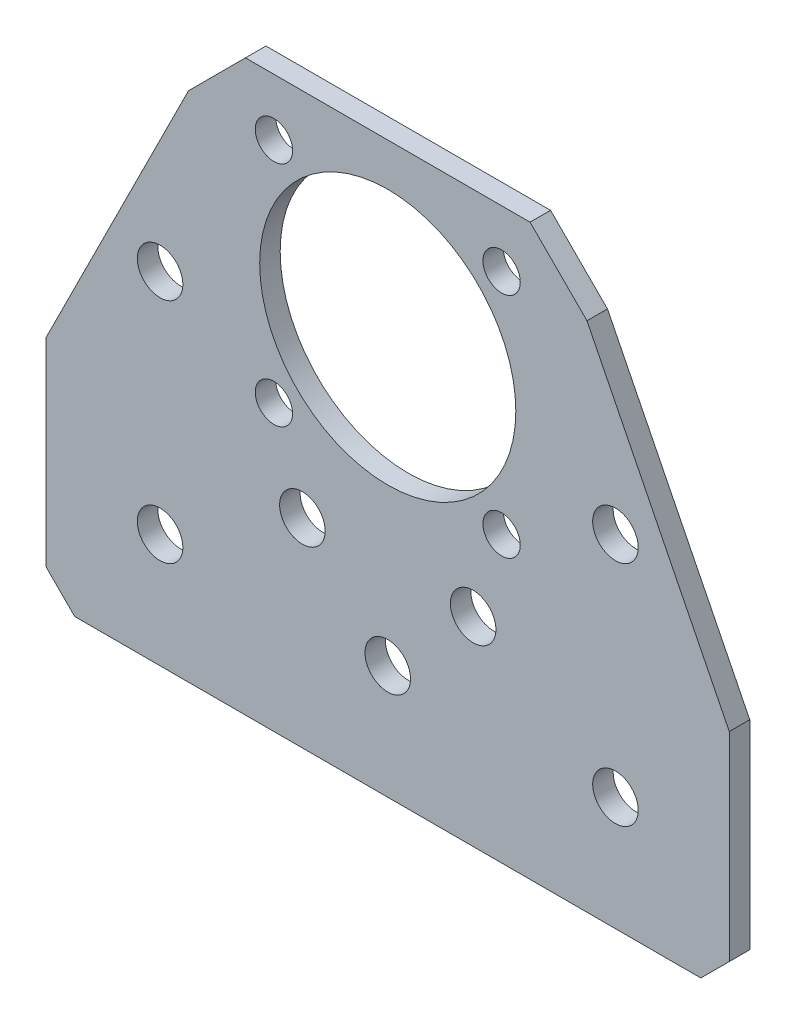
ISO-10303-21;
HEADER;
FILE_DESCRIPTION(('STEP AP214'),'2;1');
FILE_NAME('part.step','',(''),(''),'','','');
FILE_SCHEMA(('AUTOMOTIVE_DESIGN { 1 0 10303 214 1 1 1 1 }'));
ENDSEC;
DATA;
#1=APPLICATION_CONTEXT('core data for automotive mechanical design processes');
#2=APPLICATION_PROTOCOL_DEFINITION('international standard','automotive_design',2000,#1);
#3=PRODUCT_CONTEXT('',#1,'mechanical');
#4=PRODUCT('Part','Part','',(#3));
#5=PRODUCT_RELATED_PRODUCT_CATEGORY('part','',(#4));
#6=PRODUCT_DEFINITION_FORMATION('','',#4);
#7=PRODUCT_DEFINITION_CONTEXT('part definition',#1,'design');
#8=PRODUCT_DEFINITION('design','',#6,#7);
#9=PRODUCT_DEFINITION_SHAPE('','',#8);
#10=(LENGTH_UNIT() NAMED_UNIT(*) SI_UNIT(.MILLI.,.METRE.));
#11=(NAMED_UNIT(*) PLANE_ANGLE_UNIT() SI_UNIT($,.RADIAN.));
#12=(NAMED_UNIT(*) SI_UNIT($,.STERADIAN.) SOLID_ANGLE_UNIT());
#13=UNCERTAINTY_MEASURE_WITH_UNIT(LENGTH_MEASURE(1.E-05),#10,'distance_accuracy_value','');
#14=(GEOMETRIC_REPRESENTATION_CONTEXT(3) GLOBAL_UNCERTAINTY_ASSIGNED_CONTEXT((#13)) GLOBAL_UNIT_ASSIGNED_CONTEXT((#10,
#11,#12)) REPRESENTATION_CONTEXT('',''));
#15=CARTESIAN_POINT('',(0.,0.,0.));
#16=DIRECTION('',(0.,0.,1.));
#17=DIRECTION('',(1.,0.,0.));
#18=AXIS2_PLACEMENT_3D('',#15,#16,#17);
#19=CARTESIAN_POINT('',(0.,0.,-2.286));
#20=DIRECTION('',(0.,0.,1.));
#21=DIRECTION('',(1.,0.,0.));
#22=AXIS2_PLACEMENT_3D('',#19,#20,#21);
#23=PLANE('',#22);
#24=CARTESIAN_POINT('',(-25.4,0.,-2.286));
#25=DIRECTION('',(0.,0.,-1.));
#26=DIRECTION('',(-1.,0.,0.));
#27=AXIS2_PLACEMENT_3D('',#24,#25,#26);
#28=CIRCLE('',#27,2.54);
#29=CARTESIAN_POINT('',(-27.94,0.,-2.286));
#30=VERTEX_POINT('',#29);
#31=EDGE_CURVE('E155',#30,#30,#28,.F.);
#32=ORIENTED_EDGE('',*,*,#31,.T.);
#33=EDGE_LOOP('',(#32));
#34=FACE_BOUND('',#33,.T.);
#35=DIRECTION('',(-0.707106781186549,0.707106781186546,0.));
#36=VECTOR('',#35,1.);
#37=CARTESIAN_POINT('',(-38.1,-9.525,-2.286));
#38=LINE('',#37,#36);
#39=CARTESIAN_POINT('',(-34.925,-12.7,-2.286));
#40=VERTEX_POINT('',#39);
#41=CARTESIAN_POINT('',(-38.1,-9.525,-2.286));
#42=VERTEX_POINT('',#41);
#43=EDGE_CURVE('E92',#40,#42,#38,.T.);
#44=ORIENTED_EDGE('',*,*,#43,.T.);
#45=DIRECTION('',(0.,1.,0.));
#46=VECTOR('',#45,1.);
#47=CARTESIAN_POINT('',(-38.1,12.7,-2.286));
#48=LINE('',#47,#46);
#49=CARTESIAN_POINT('',(-38.1,12.7,-2.286));
#50=VERTEX_POINT('',#49);
#51=EDGE_CURVE('E97',#50,#42,#48,.F.);
#52=ORIENTED_EDGE('',*,*,#51,.F.);
#53=DIRECTION('',(-0.447213595499958,-0.894427190999916,0.));
#54=VECTOR('',#53,1.);
#55=CARTESIAN_POINT('',(-38.1,12.7,-2.286));
#56=LINE('',#55,#54);
#57=CARTESIAN_POINT('',(-22.225,44.45,-2.286));
#58=VERTEX_POINT('',#57);
#59=EDGE_CURVE('E524',#58,#50,#56,.T.);
#60=ORIENTED_EDGE('',*,*,#59,.F.);
#61=DIRECTION('',(0.707106781186549,0.707106781186546,0.));
#62=VECTOR('',#61,1.);
#63=CARTESIAN_POINT('',(-15.875,50.8,-2.286));
#64=LINE('',#63,#62);
#65=CARTESIAN_POINT('',(-15.875,50.8,-2.286));
#66=VERTEX_POINT('',#65);
#67=EDGE_CURVE('E520',#58,#66,#64,.T.);
#68=ORIENTED_EDGE('',*,*,#67,.T.);
#69=DIRECTION('',(1.,0.,0.));
#70=VECTOR('',#69,1.);
#71=CARTESIAN_POINT('',(-19.05,50.8,-2.286));
#72=LINE('',#71,#70);
#73=CARTESIAN_POINT('',(15.875,50.8,-2.286));
#74=VERTEX_POINT('',#73);
#75=EDGE_CURVE('E516',#74,#66,#72,.F.);
#76=ORIENTED_EDGE('',*,*,#75,.F.);
#77=DIRECTION('',(0.70710678118655,-0.707106781186545,0.));
#78=VECTOR('',#77,1.);
#79=CARTESIAN_POINT('',(22.225,44.45,-2.286));
#80=LINE('',#79,#78);
#81=CARTESIAN_POINT('',(22.225,44.4500000000001,-2.286));
#82=VERTEX_POINT('',#81);
#83=EDGE_CURVE('E510',#74,#82,#80,.T.);
#84=ORIENTED_EDGE('',*,*,#83,.T.);
#85=DIRECTION('',(-0.447213595499958,0.894427190999916,0.));
#86=VECTOR('',#85,1.);
#87=CARTESIAN_POINT('',(19.05,50.8,-2.286));
#88=LINE('',#87,#86);
#89=CARTESIAN_POINT('',(38.1,12.7,-2.286));
#90=VERTEX_POINT('',#89);
#91=EDGE_CURVE('E503',#90,#82,#88,.T.);
#92=ORIENTED_EDGE('',*,*,#91,.F.);
#93=DIRECTION('',(0.,1.,0.));
#94=VECTOR('',#93,1.);
#95=CARTESIAN_POINT('',(38.1,12.7,-2.286));
#96=LINE('',#95,#94);
#97=CARTESIAN_POINT('',(38.1,-9.52499999999999,-2.286));
#98=VERTEX_POINT('',#97);
#99=EDGE_CURVE('E492',#98,#90,#96,.T.);
#100=ORIENTED_EDGE('',*,*,#99,.F.);
#101=DIRECTION('',(-0.707106781186544,-0.707106781186551,0.));
#102=VECTOR('',#101,1.);
#103=CARTESIAN_POINT('',(34.925,-12.7,-2.286));
#104=LINE('',#103,#102);
#105=CARTESIAN_POINT('',(34.925,-12.7,-2.286));
#106=VERTEX_POINT('',#105);
#107=EDGE_CURVE('E490',#98,#106,#104,.T.);
#108=ORIENTED_EDGE('',*,*,#107,.T.);
#109=DIRECTION('',(1.,0.,0.));
#110=VECTOR('',#109,1.);
#111=CARTESIAN_POINT('',(-38.1,-12.7,-2.286));
#112=LINE('',#111,#110);
#113=EDGE_CURVE('E110',#40,#106,#112,.T.);
#114=ORIENTED_EDGE('',*,*,#113,.F.);
#115=EDGE_LOOP('',(#44,#52,#60,#68,#76,#84,#92,#100,#108,#114));
#116=FACE_BOUND('',#115,.T.);
#117=CARTESIAN_POINT('',(0.,31.75,-2.286));
#118=DIRECTION('',(0.,0.,1.));
#119=DIRECTION('',(1.,0.,0.));
#120=AXIS2_PLACEMENT_3D('',#117,#118,#119);
#121=CIRCLE('',#120,14.2875);
#122=CARTESIAN_POINT('',(14.2875,31.75,-2.286));
#123=VERTEX_POINT('',#122);
#124=EDGE_CURVE('E106',#123,#123,#121,.T.);
#125=ORIENTED_EDGE('',*,*,#124,.T.);
#126=EDGE_LOOP('',(#125));
#127=FACE_BOUND('',#126,.T.);
#128=CARTESIAN_POINT('',(-12.7,44.45,-2.286));
#129=DIRECTION('',(0.,0.,1.));
#130=DIRECTION('',(1.,0.,0.));
#131=AXIS2_PLACEMENT_3D('',#128,#129,#130);
#132=CIRCLE('',#131,2.0828);
#133=CARTESIAN_POINT('',(-10.6172,44.45,-2.286));
#134=VERTEX_POINT('',#133);
#135=EDGE_CURVE('E160',#134,#134,#132,.T.);
#136=ORIENTED_EDGE('',*,*,#135,.T.);
#137=EDGE_LOOP('',(#136));
#138=FACE_BOUND('',#137,.T.);
#139=CARTESIAN_POINT('',(12.7,44.45,-2.286));
#140=DIRECTION('',(0.,0.,1.));
#141=DIRECTION('',(1.,0.,0.));
#142=AXIS2_PLACEMENT_3D('',#139,#140,#141);
#143=CIRCLE('',#142,2.0828);
#144=CARTESIAN_POINT('',(14.7828,44.45,-2.286));
#145=VERTEX_POINT('',#144);
#146=EDGE_CURVE('E163',#145,#145,#143,.T.);
#147=ORIENTED_EDGE('',*,*,#146,.T.);
#148=EDGE_LOOP('',(#147));
#149=FACE_BOUND('',#148,.T.);
#150=CARTESIAN_POINT('',(-12.7,19.05,-2.286));
#151=DIRECTION('',(0.,0.,1.));
#152=DIRECTION('',(1.,0.,0.));
#153=AXIS2_PLACEMENT_3D('',#150,#151,#152);
#154=CIRCLE('',#153,2.0828);
#155=CARTESIAN_POINT('',(-10.6172,19.05,-2.286));
#156=VERTEX_POINT('',#155);
#157=EDGE_CURVE('E166',#156,#156,#154,.T.);
#158=ORIENTED_EDGE('',*,*,#157,.T.);
#159=EDGE_LOOP('',(#158));
#160=FACE_BOUND('',#159,.T.);
#161=CARTESIAN_POINT('',(12.7,19.05,-2.286));
#162=DIRECTION('',(0.,0.,1.));
#163=DIRECTION('',(1.,0.,0.));
#164=AXIS2_PLACEMENT_3D('',#161,#162,#163);
#165=CIRCLE('',#164,2.0828);
#166=CARTESIAN_POINT('',(14.7828,19.05,-2.286));
#167=VERTEX_POINT('',#166);
#168=EDGE_CURVE('E169',#167,#167,#165,.T.);
#169=ORIENTED_EDGE('',*,*,#168,.T.);
#170=EDGE_LOOP('',(#169));
#171=FACE_BOUND('',#170,.T.);
#172=CARTESIAN_POINT('',(25.4,0.,-2.286));
#173=DIRECTION('',(0.,0.,-1.));
#174=DIRECTION('',(-1.,0.,0.));
#175=AXIS2_PLACEMENT_3D('',#172,#173,#174);
#176=CIRCLE('',#175,2.54);
#177=CARTESIAN_POINT('',(22.86,0.,-2.286));
#178=VERTEX_POINT('',#177);
#179=EDGE_CURVE('E172',#178,#178,#176,.F.);
#180=ORIENTED_EDGE('',*,*,#179,.T.);
#181=EDGE_LOOP('',(#180));
#182=FACE_BOUND('',#181,.T.);
#183=CARTESIAN_POINT('',(0.,0.,-2.286));
#184=DIRECTION('',(0.,0.,-1.));
#185=DIRECTION('',(-1.,0.,0.));
#186=AXIS2_PLACEMENT_3D('',#183,#184,#185);
#187=CIRCLE('',#186,2.54);
#188=CARTESIAN_POINT('',(-2.53999999999999,0.,-2.286));
#189=VERTEX_POINT('',#188);
#190=EDGE_CURVE('E175',#189,#189,#187,.F.);
#191=ORIENTED_EDGE('',*,*,#190,.T.);
#192=EDGE_LOOP('',(#191));
#193=FACE_BOUND('',#192,.T.);
#194=CARTESIAN_POINT('',(-9.525,9.525,-2.286));
#195=DIRECTION('',(0.,0.,1.));
#196=DIRECTION('',(1.,0.,0.));
#197=AXIS2_PLACEMENT_3D('',#194,#195,#196);
#198=CIRCLE('',#197,2.54);
#199=CARTESIAN_POINT('',(-6.985,9.525,-2.286));
#200=VERTEX_POINT('',#199);
#201=EDGE_CURVE('E178',#200,#200,#198,.T.);
#202=ORIENTED_EDGE('',*,*,#201,.T.);
#203=EDGE_LOOP('',(#202));
#204=FACE_BOUND('',#203,.T.);
#205=CARTESIAN_POINT('',(9.525,9.525,-2.286));
#206=DIRECTION('',(0.,0.,1.));
#207=DIRECTION('',(1.,0.,0.));
#208=AXIS2_PLACEMENT_3D('',#205,#206,#207);
#209=CIRCLE('',#208,2.54);
#210=CARTESIAN_POINT('',(12.065,9.525,-2.286));
#211=VERTEX_POINT('',#210);
#212=EDGE_CURVE('E181',#211,#211,#209,.T.);
#213=ORIENTED_EDGE('',*,*,#212,.T.);
#214=EDGE_LOOP('',(#213));
#215=FACE_BOUND('',#214,.T.);
#216=CARTESIAN_POINT('',(25.4,25.4,-2.286));
#217=DIRECTION('',(0.,0.,-1.));
#218=DIRECTION('',(-1.,0.,0.));
#219=AXIS2_PLACEMENT_3D('',#216,#217,#218);
#220=CIRCLE('',#219,2.54);
#221=CARTESIAN_POINT('',(22.86,25.4,-2.286));
#222=VERTEX_POINT('',#221);
#223=EDGE_CURVE('E183',#222,#222,#220,.F.);
#224=ORIENTED_EDGE('',*,*,#223,.T.);
#225=EDGE_LOOP('',(#224));
#226=FACE_BOUND('',#225,.T.);
#227=CARTESIAN_POINT('',(-25.4,25.4,-2.286));
#228=DIRECTION('',(0.,0.,-1.));
#229=DIRECTION('',(-1.,0.,0.));
#230=AXIS2_PLACEMENT_3D('',#227,#228,#229);
#231=CIRCLE('',#230,2.54);
#232=CARTESIAN_POINT('',(-27.94,25.4,-2.286));
#233=VERTEX_POINT('',#232);
#234=EDGE_CURVE('E21',#233,#233,#231,.F.);
#235=ORIENTED_EDGE('',*,*,#234,.T.);
#236=EDGE_LOOP('',(#235));
#237=FACE_BOUND('',#236,.T.);
#238=ADVANCED_FACE('F18',(#34,#116,#127,#138,#149,#160,#171,#182,#193,#204,#215,#226,#237),#23,.F.);
#239=CARTESIAN_POINT('',(-25.4,25.4,0.254));
#240=DIRECTION('',(0.,0.,-1.));
#241=DIRECTION('',(-1.,0.,0.));
#242=AXIS2_PLACEMENT_3D('',#239,#240,#241);
#243=CYLINDRICAL_SURFACE('',#242,2.54);
#244=CARTESIAN_POINT('',(-25.4,25.4,0.));
#245=DIRECTION('',(0.,0.,-1.));
#246=DIRECTION('',(-1.,0.,0.));
#247=AXIS2_PLACEMENT_3D('',#244,#245,#246);
#248=CIRCLE('',#247,2.54);
#249=CARTESIAN_POINT('',(-27.94,25.4,0.));
#250=VERTEX_POINT('',#249);
#251=EDGE_CURVE('E152',#250,#250,#248,.T.);
#252=ORIENTED_EDGE('',*,*,#251,.F.);
#253=EDGE_LOOP('',(#252));
#254=FACE_BOUND('',#253,.T.);
#255=ORIENTED_EDGE('',*,*,#234,.F.);
#256=EDGE_LOOP('',(#255));
#257=FACE_BOUND('',#256,.T.);
#258=ADVANCED_FACE('F191',(#254,#257),#243,.F.);
#259=CARTESIAN_POINT('',(25.4,25.4,0.254));
#260=DIRECTION('',(0.,0.,-1.));
#261=DIRECTION('',(-1.,0.,0.));
#262=AXIS2_PLACEMENT_3D('',#259,#260,#261);
#263=CYLINDRICAL_SURFACE('',#262,2.54);
#264=CARTESIAN_POINT('',(25.4,25.4,0.));
#265=DIRECTION('',(0.,0.,-1.));
#266=DIRECTION('',(-1.,0.,0.));
#267=AXIS2_PLACEMENT_3D('',#264,#265,#266);
#268=CIRCLE('',#267,2.54);
#269=CARTESIAN_POINT('',(22.86,25.4,0.));
#270=VERTEX_POINT('',#269);
#271=EDGE_CURVE('E149',#270,#270,#268,.T.);
#272=ORIENTED_EDGE('',*,*,#271,.F.);
#273=EDGE_LOOP('',(#272));
#274=FACE_BOUND('',#273,.T.);
#275=ORIENTED_EDGE('',*,*,#223,.F.);
#276=EDGE_LOOP('',(#275));
#277=FACE_BOUND('',#276,.T.);
#278=ADVANCED_FACE('F193',(#274,#277),#263,.F.);
#279=CARTESIAN_POINT('',(9.525,9.525,-2.54));
#280=DIRECTION('',(0.,0.,1.));
#281=DIRECTION('',(1.,0.,0.));
#282=AXIS2_PLACEMENT_3D('',#279,#280,#281);
#283=CYLINDRICAL_SURFACE('',#282,2.54);
#284=CARTESIAN_POINT('',(9.525,9.525,0.));
#285=DIRECTION('',(0.,0.,1.));
#286=DIRECTION('',(1.,0.,0.));
#287=AXIS2_PLACEMENT_3D('',#284,#285,#286);
#288=CIRCLE('',#287,2.54);
#289=CARTESIAN_POINT('',(12.065,9.525,0.));
#290=VERTEX_POINT('',#289);
#291=EDGE_CURVE('E146',#290,#290,#288,.F.);
#292=ORIENTED_EDGE('',*,*,#291,.F.);
#293=EDGE_LOOP('',(#292));
#294=FACE_BOUND('',#293,.T.);
#295=ORIENTED_EDGE('',*,*,#212,.F.);
#296=EDGE_LOOP('',(#295));
#297=FACE_BOUND('',#296,.T.);
#298=ADVANCED_FACE('F200',(#294,#297),#283,.F.);
#299=CARTESIAN_POINT('',(-9.525,9.525,-2.54));
#300=DIRECTION('',(0.,0.,1.));
#301=DIRECTION('',(1.,0.,0.));
#302=AXIS2_PLACEMENT_3D('',#299,#300,#301);
#303=CYLINDRICAL_SURFACE('',#302,2.54);
#304=CARTESIAN_POINT('',(-9.525,9.525,0.));
#305=DIRECTION('',(0.,0.,1.));
#306=DIRECTION('',(1.,0.,0.));
#307=AXIS2_PLACEMENT_3D('',#304,#305,#306);
#308=CIRCLE('',#307,2.54);
#309=CARTESIAN_POINT('',(-6.985,9.525,0.));
#310=VERTEX_POINT('',#309);
#311=EDGE_CURVE('E143',#310,#310,#308,.F.);
#312=ORIENTED_EDGE('',*,*,#311,.F.);
#313=EDGE_LOOP('',(#312));
#314=FACE_BOUND('',#313,.T.);
#315=ORIENTED_EDGE('',*,*,#201,.F.);
#316=EDGE_LOOP('',(#315));
#317=FACE_BOUND('',#316,.T.);
#318=ADVANCED_FACE('F279',(#314,#317),#303,.F.);
#319=CARTESIAN_POINT('',(0.,0.,0.254));
#320=DIRECTION('',(0.,0.,-1.));
#321=DIRECTION('',(-1.,0.,0.));
#322=AXIS2_PLACEMENT_3D('',#319,#320,#321);
#323=CYLINDRICAL_SURFACE('',#322,2.54);
#324=CARTESIAN_POINT('',(0.,0.,0.));
#325=DIRECTION('',(0.,0.,-1.));
#326=DIRECTION('',(-1.,0.,0.));
#327=AXIS2_PLACEMENT_3D('',#324,#325,#326);
#328=CIRCLE('',#327,2.54);
#329=CARTESIAN_POINT('',(-2.53999999999999,0.,0.));
#330=VERTEX_POINT('',#329);
#331=EDGE_CURVE('E140',#330,#330,#328,.T.);
#332=ORIENTED_EDGE('',*,*,#331,.F.);
#333=EDGE_LOOP('',(#332));
#334=FACE_BOUND('',#333,.T.);
#335=ORIENTED_EDGE('',*,*,#190,.F.);
#336=EDGE_LOOP('',(#335));
#337=FACE_BOUND('',#336,.T.);
#338=ADVANCED_FACE('F275',(#334,#337),#323,.F.);
#339=CARTESIAN_POINT('',(25.4,0.,0.254));
#340=DIRECTION('',(0.,0.,-1.));
#341=DIRECTION('',(-1.,0.,0.));
#342=AXIS2_PLACEMENT_3D('',#339,#340,#341);
#343=CYLINDRICAL_SURFACE('',#342,2.54);
#344=CARTESIAN_POINT('',(25.4,0.,0.));
#345=DIRECTION('',(0.,0.,-1.));
#346=DIRECTION('',(-1.,0.,0.));
#347=AXIS2_PLACEMENT_3D('',#344,#345,#346);
#348=CIRCLE('',#347,2.54);
#349=CARTESIAN_POINT('',(22.86,0.,0.));
#350=VERTEX_POINT('',#349);
#351=EDGE_CURVE('E137',#350,#350,#348,.T.);
#352=ORIENTED_EDGE('',*,*,#351,.F.);
#353=EDGE_LOOP('',(#352));
#354=FACE_BOUND('',#353,.T.);
#355=ORIENTED_EDGE('',*,*,#179,.F.);
#356=EDGE_LOOP('',(#355));
#357=FACE_BOUND('',#356,.T.);
#358=ADVANCED_FACE('F271',(#354,#357),#343,.F.);
#359=CARTESIAN_POINT('',(12.7,19.05,-2.286));
#360=DIRECTION('',(0.,0.,1.));
#361=DIRECTION('',(1.,0.,0.));
#362=AXIS2_PLACEMENT_3D('',#359,#360,#361);
#363=CYLINDRICAL_SURFACE('',#362,2.0828);
#364=CARTESIAN_POINT('',(12.7,19.05,0.));
#365=DIRECTION('',(0.,0.,1.));
#366=DIRECTION('',(1.,0.,0.));
#367=AXIS2_PLACEMENT_3D('',#364,#365,#366);
#368=CIRCLE('',#367,2.0828);
#369=CARTESIAN_POINT('',(14.7828,19.05,0.));
#370=VERTEX_POINT('',#369);
#371=EDGE_CURVE('E134',#370,#370,#368,.F.);
#372=ORIENTED_EDGE('',*,*,#371,.F.);
#373=EDGE_LOOP('',(#372));
#374=FACE_BOUND('',#373,.T.);
#375=ORIENTED_EDGE('',*,*,#168,.F.);
#376=EDGE_LOOP('',(#375));
#377=FACE_BOUND('',#376,.T.);
#378=ADVANCED_FACE('F267',(#374,#377),#363,.F.);
#379=CARTESIAN_POINT('',(-12.7,19.05,-2.286));
#380=DIRECTION('',(0.,0.,1.));
#381=DIRECTION('',(1.,0.,0.));
#382=AXIS2_PLACEMENT_3D('',#379,#380,#381);
#383=CYLINDRICAL_SURFACE('',#382,2.0828);
#384=CARTESIAN_POINT('',(-12.7,19.05,0.));
#385=DIRECTION('',(0.,0.,1.));
#386=DIRECTION('',(1.,0.,0.));
#387=AXIS2_PLACEMENT_3D('',#384,#385,#386);
#388=CIRCLE('',#387,2.0828);
#389=CARTESIAN_POINT('',(-10.6172,19.05,0.));
#390=VERTEX_POINT('',#389);
#391=EDGE_CURVE('E131',#390,#390,#388,.F.);
#392=ORIENTED_EDGE('',*,*,#391,.F.);
#393=EDGE_LOOP('',(#392));
#394=FACE_BOUND('',#393,.T.);
#395=ORIENTED_EDGE('',*,*,#157,.F.);
#396=EDGE_LOOP('',(#395));
#397=FACE_BOUND('',#396,.T.);
#398=ADVANCED_FACE('F263',(#394,#397),#383,.F.);
#399=CARTESIAN_POINT('',(12.7,44.45,-2.286));
#400=DIRECTION('',(0.,0.,1.));
#401=DIRECTION('',(1.,0.,0.));
#402=AXIS2_PLACEMENT_3D('',#399,#400,#401);
#403=CYLINDRICAL_SURFACE('',#402,2.0828);
#404=CARTESIAN_POINT('',(12.7,44.45,0.));
#405=DIRECTION('',(0.,0.,1.));
#406=DIRECTION('',(1.,0.,0.));
#407=AXIS2_PLACEMENT_3D('',#404,#405,#406);
#408=CIRCLE('',#407,2.0828);
#409=CARTESIAN_POINT('',(14.7828,44.45,0.));
#410=VERTEX_POINT('',#409);
#411=EDGE_CURVE('E128',#410,#410,#408,.F.);
#412=ORIENTED_EDGE('',*,*,#411,.F.);
#413=EDGE_LOOP('',(#412));
#414=FACE_BOUND('',#413,.T.);
#415=ORIENTED_EDGE('',*,*,#146,.F.);
#416=EDGE_LOOP('',(#415));
#417=FACE_BOUND('',#416,.T.);
#418=ADVANCED_FACE('F259',(#414,#417),#403,.F.);
#419=CARTESIAN_POINT('',(-12.7,44.45,-2.286));
#420=DIRECTION('',(0.,0.,1.));
#421=DIRECTION('',(1.,0.,0.));
#422=AXIS2_PLACEMENT_3D('',#419,#420,#421);
#423=CYLINDRICAL_SURFACE('',#422,2.0828);
#424=CARTESIAN_POINT('',(-12.7,44.45,0.));
#425=DIRECTION('',(0.,0.,1.));
#426=DIRECTION('',(1.,0.,0.));
#427=AXIS2_PLACEMENT_3D('',#424,#425,#426);
#428=CIRCLE('',#427,2.0828);
#429=CARTESIAN_POINT('',(-10.6172,44.45,0.));
#430=VERTEX_POINT('',#429);
#431=EDGE_CURVE('E125',#430,#430,#428,.F.);
#432=ORIENTED_EDGE('',*,*,#431,.F.);
#433=EDGE_LOOP('',(#432));
#434=FACE_BOUND('',#433,.T.);
#435=ORIENTED_EDGE('',*,*,#135,.F.);
#436=EDGE_LOOP('',(#435));
#437=FACE_BOUND('',#436,.T.);
#438=ADVANCED_FACE('F255',(#434,#437),#423,.F.);
#439=CARTESIAN_POINT('',(0.,31.75,-2.286));
#440=DIRECTION('',(0.,0.,1.));
#441=DIRECTION('',(1.,0.,0.));
#442=AXIS2_PLACEMENT_3D('',#439,#440,#441);
#443=CYLINDRICAL_SURFACE('',#442,14.2875);
#444=CARTESIAN_POINT('',(0.,31.75,0.));
#445=DIRECTION('',(0.,0.,1.));
#446=DIRECTION('',(1.,0.,0.));
#447=AXIS2_PLACEMENT_3D('',#444,#445,#446);
#448=CIRCLE('',#447,14.2875);
#449=CARTESIAN_POINT('',(14.2875,31.75,0.));
#450=VERTEX_POINT('',#449);
#451=EDGE_CURVE('E121',#450,#450,#448,.F.);
#452=ORIENTED_EDGE('',*,*,#451,.F.);
#453=EDGE_LOOP('',(#452));
#454=FACE_BOUND('',#453,.T.);
#455=ORIENTED_EDGE('',*,*,#124,.F.);
#456=EDGE_LOOP('',(#455));
#457=FACE_BOUND('',#456,.T.);
#458=ADVANCED_FACE('F252',(#454,#457),#443,.F.);
#459=CARTESIAN_POINT('',(-38.1,12.7,-2.286));
#460=DIRECTION('',(-1.,0.,0.));
#461=DIRECTION('',(0.,0.,1.));
#462=AXIS2_PLACEMENT_3D('',#459,#460,#461);
#463=PLANE('',#462);
#464=DIRECTION('',(0.,1.,0.));
#465=VECTOR('',#464,1.);
#466=CARTESIAN_POINT('',(-38.1,0.,0.));
#467=LINE('',#466,#465);
#468=CARTESIAN_POINT('',(-38.1,12.7,0.));
#469=VERTEX_POINT('',#468);
#470=CARTESIAN_POINT('',(-38.1,-9.525,0.));
#471=VERTEX_POINT('',#470);
#472=EDGE_CURVE('E124',#469,#471,#467,.F.);
#473=ORIENTED_EDGE('',*,*,#472,.F.);
#474=DIRECTION('',(0.,0.,1.));
#475=VECTOR('',#474,1.);
#476=CARTESIAN_POINT('',(-38.1,12.7,-2.286));
#477=LINE('',#476,#475);
#478=EDGE_CURVE('E102',#50,#469,#477,.T.);
#479=ORIENTED_EDGE('',*,*,#478,.F.);
#480=ORIENTED_EDGE('',*,*,#51,.T.);
#481=DIRECTION('',(0.,0.,1.));
#482=VECTOR('',#481,1.);
#483=CARTESIAN_POINT('',(-38.1,-9.525,-2.286));
#484=LINE('',#483,#482);
#485=EDGE_CURVE('E99',#42,#471,#484,.T.);
#486=ORIENTED_EDGE('',*,*,#485,.T.);
#487=EDGE_LOOP('',(#473,#479,#480,#486));
#488=FACE_BOUND('',#487,.T.);
#489=ADVANCED_FACE('F98',(#488),#463,.T.);
#490=CARTESIAN_POINT('',(-38.1,-9.525,-2.286));
#491=DIRECTION('',(0.707106781186546,0.707106781186549,0.));
#492=DIRECTION('',(-0.707106781186549,0.707106781186546,0.));
#493=AXIS2_PLACEMENT_3D('',#490,#491,#492);
#494=PLANE('',#493);
#495=DIRECTION('',(0.,0.,-1.));
#496=VECTOR('',#495,1.);
#497=CARTESIAN_POINT('',(-34.925,-12.7,-2.286));
#498=LINE('',#497,#496);
#499=CARTESIAN_POINT('',(-34.925,-12.7,0.));
#500=VERTEX_POINT('',#499);
#501=EDGE_CURVE('E112',#500,#40,#498,.T.);
#502=ORIENTED_EDGE('',*,*,#501,.F.);
#503=DIRECTION('',(0.707106781186548,-0.707106781186547,0.));
#504=VECTOR('',#503,1.);
#505=CARTESIAN_POINT('',(-38.1,-9.525,0.));
#506=LINE('',#505,#504);
#507=EDGE_CURVE('E116',#471,#500,#506,.T.);
#508=ORIENTED_EDGE('',*,*,#507,.F.);
#509=ORIENTED_EDGE('',*,*,#485,.F.);
#510=ORIENTED_EDGE('',*,*,#43,.F.);
#511=EDGE_LOOP('',(#502,#508,#509,#510));
#512=FACE_BOUND('',#511,.T.);
#513=ADVANCED_FACE('F114',(#512),#494,.F.);
#514=CARTESIAN_POINT('',(-38.1,-12.7,-2.286));
#515=DIRECTION('',(0.,-1.,0.));
#516=DIRECTION('',(0.,0.,-1.));
#517=AXIS2_PLACEMENT_3D('',#514,#515,#516);
#518=PLANE('',#517);
#519=ORIENTED_EDGE('',*,*,#113,.T.);
#520=DIRECTION('',(0.,0.,1.));
#521=VECTOR('',#520,1.);
#522=CARTESIAN_POINT('',(34.925,-12.7,-2.286));
#523=LINE('',#522,#521);
#524=CARTESIAN_POINT('',(34.925,-12.7,0.));
#525=VERTEX_POINT('',#524);
#526=EDGE_CURVE('E486',#106,#525,#523,.T.);
#527=ORIENTED_EDGE('',*,*,#526,.T.);
#528=DIRECTION('',(1.,0.,0.));
#529=VECTOR('',#528,1.);
#530=CARTESIAN_POINT('',(0.,-12.7,0.));
#531=LINE('',#530,#529);
#532=EDGE_CURVE('E529',#500,#525,#531,.T.);
#533=ORIENTED_EDGE('',*,*,#532,.F.);
#534=ORIENTED_EDGE('',*,*,#501,.T.);
#535=EDGE_LOOP('',(#519,#527,#533,#534));
#536=FACE_BOUND('',#535,.T.);
#537=ADVANCED_FACE('F243',(#536),#518,.T.);
#538=CARTESIAN_POINT('',(34.925,-12.7,-2.286));
#539=DIRECTION('',(-0.707106781186551,0.707106781186544,0.));
#540=DIRECTION('',(-0.707106781186544,-0.707106781186551,0.));
#541=AXIS2_PLACEMENT_3D('',#538,#539,#540);
#542=PLANE('',#541);
#543=DIRECTION('',(0.,0.,-1.));
#544=VECTOR('',#543,1.);
#545=CARTESIAN_POINT('',(38.1,-9.52499999999999,-2.286));
#546=LINE('',#545,#544);
#547=CARTESIAN_POINT('',(38.1,-9.52499999999999,0.));
#548=VERTEX_POINT('',#547);
#549=EDGE_CURVE('E494',#548,#98,#546,.T.);
#550=ORIENTED_EDGE('',*,*,#549,.F.);
#551=DIRECTION('',(0.707106781186546,0.707106781186549,0.));
#552=VECTOR('',#551,1.);
#553=CARTESIAN_POINT('',(34.925,-12.7,0.));
#554=LINE('',#553,#552);
#555=EDGE_CURVE('E497',#525,#548,#554,.T.);
#556=ORIENTED_EDGE('',*,*,#555,.F.);
#557=ORIENTED_EDGE('',*,*,#526,.F.);
#558=ORIENTED_EDGE('',*,*,#107,.F.);
#559=EDGE_LOOP('',(#550,#556,#557,#558));
#560=FACE_BOUND('',#559,.T.);
#561=ADVANCED_FACE('F239',(#560),#542,.F.);
#562=CARTESIAN_POINT('',(38.1,12.7,-2.286));
#563=DIRECTION('',(1.,0.,0.));
#564=DIRECTION('',(0.,0.,-1.));
#565=AXIS2_PLACEMENT_3D('',#562,#563,#564);
#566=PLANE('',#565);
#567=ORIENTED_EDGE('',*,*,#99,.T.);
#568=DIRECTION('',(0.,0.,1.));
#569=VECTOR('',#568,1.);
#570=CARTESIAN_POINT('',(38.1,12.7,-2.286));
#571=LINE('',#570,#569);
#572=CARTESIAN_POINT('',(38.1,12.7,0.));
#573=VERTEX_POINT('',#572);
#574=EDGE_CURVE('E505',#573,#90,#571,.F.);
#575=ORIENTED_EDGE('',*,*,#574,.F.);
#576=DIRECTION('',(0.,1.,0.));
#577=VECTOR('',#576,1.);
#578=CARTESIAN_POINT('',(38.1,0.,0.));
#579=LINE('',#578,#577);
#580=EDGE_CURVE('E532',#548,#573,#579,.T.);
#581=ORIENTED_EDGE('',*,*,#580,.F.);
#582=ORIENTED_EDGE('',*,*,#549,.T.);
#583=EDGE_LOOP('',(#567,#575,#581,#582));
#584=FACE_BOUND('',#583,.T.);
#585=ADVANCED_FACE('F235',(#584),#566,.T.);
#586=CARTESIAN_POINT('',(19.05,50.8,-2.286));
#587=DIRECTION('',(0.894427190999916,0.447213595499958,0.));
#588=DIRECTION('',(-0.447213595499958,0.894427190999916,0.));
#589=AXIS2_PLACEMENT_3D('',#586,#587,#588);
#590=PLANE('',#589);
#591=DIRECTION('',(-0.447213595499958,0.894427190999916,0.));
#592=VECTOR('',#591,1.);
#593=CARTESIAN_POINT('',(38.1,12.7,0.));
#594=LINE('',#593,#592);
#595=CARTESIAN_POINT('',(22.225,44.4500000000001,0.));
#596=VERTEX_POINT('',#595);
#597=EDGE_CURVE('E535',#573,#596,#594,.T.);
#598=ORIENTED_EDGE('',*,*,#597,.F.);
#599=ORIENTED_EDGE('',*,*,#574,.T.);
#600=ORIENTED_EDGE('',*,*,#91,.T.);
#601=DIRECTION('',(0.,0.,1.));
#602=VECTOR('',#601,1.);
#603=CARTESIAN_POINT('',(22.225,44.4500000000001,-2.286));
#604=LINE('',#603,#602);
#605=EDGE_CURVE('E508',#82,#596,#604,.T.);
#606=ORIENTED_EDGE('',*,*,#605,.T.);
#607=EDGE_LOOP('',(#598,#599,#600,#606));
#608=FACE_BOUND('',#607,.T.);
#609=ADVANCED_FACE('F231',(#608),#590,.T.);
#610=CARTESIAN_POINT('',(22.225,44.45,-2.286));
#611=DIRECTION('',(-0.707106781186545,-0.70710678118655,0.));
#612=DIRECTION('',(0.70710678118655,-0.707106781186545,0.));
#613=AXIS2_PLACEMENT_3D('',#610,#611,#612);
#614=PLANE('',#613);
#615=DIRECTION('',(0.,0.,1.));
#616=VECTOR('',#615,1.);
#617=CARTESIAN_POINT('',(15.875,50.8,-2.286));
#618=LINE('',#617,#616);
#619=CARTESIAN_POINT('',(15.875,50.8,0.));
#620=VERTEX_POINT('',#619);
#621=EDGE_CURVE('E513',#620,#74,#618,.F.);
#622=ORIENTED_EDGE('',*,*,#621,.F.);
#623=DIRECTION('',(-0.707106781186551,0.707106781186544,0.));
#624=VECTOR('',#623,1.);
#625=CARTESIAN_POINT('',(22.225,44.4500000000001,0.));
#626=LINE('',#625,#624);
#627=EDGE_CURVE('E538',#596,#620,#626,.T.);
#628=ORIENTED_EDGE('',*,*,#627,.F.);
#629=ORIENTED_EDGE('',*,*,#605,.F.);
#630=ORIENTED_EDGE('',*,*,#83,.F.);
#631=EDGE_LOOP('',(#622,#628,#629,#630));
#632=FACE_BOUND('',#631,.T.);
#633=ADVANCED_FACE('F227',(#632),#614,.F.);
#634=CARTESIAN_POINT('',(-19.05,50.8,-2.286));
#635=DIRECTION('',(0.,1.,0.));
#636=DIRECTION('',(0.,0.,1.));
#637=AXIS2_PLACEMENT_3D('',#634,#635,#636);
#638=PLANE('',#637);
#639=ORIENTED_EDGE('',*,*,#75,.T.);
#640=DIRECTION('',(0.,0.,1.));
#641=VECTOR('',#640,1.);
#642=CARTESIAN_POINT('',(-15.875,50.8,-2.286));
#643=LINE('',#642,#641);
#644=CARTESIAN_POINT('',(-15.875,50.8,0.));
#645=VERTEX_POINT('',#644);
#646=EDGE_CURVE('E518',#66,#645,#643,.T.);
#647=ORIENTED_EDGE('',*,*,#646,.T.);
#648=DIRECTION('',(1.,0.,0.));
#649=VECTOR('',#648,1.);
#650=CARTESIAN_POINT('',(0.,50.8,0.));
#651=LINE('',#650,#649);
#652=EDGE_CURVE('E541',#620,#645,#651,.F.);
#653=ORIENTED_EDGE('',*,*,#652,.F.);
#654=ORIENTED_EDGE('',*,*,#621,.T.);
#655=EDGE_LOOP('',(#639,#647,#653,#654));
#656=FACE_BOUND('',#655,.T.);
#657=ADVANCED_FACE('F224',(#656),#638,.T.);
#658=CARTESIAN_POINT('',(-15.875,50.8,-2.286));
#659=DIRECTION('',(0.707106781186546,-0.707106781186549,0.));
#660=DIRECTION('',(0.707106781186549,0.707106781186546,0.));
#661=AXIS2_PLACEMENT_3D('',#658,#659,#660);
#662=PLANE('',#661);
#663=DIRECTION('',(0.,0.,1.));
#664=VECTOR('',#663,1.);
#665=CARTESIAN_POINT('',(-22.225,44.45,-2.286));
#666=LINE('',#665,#664);
#667=CARTESIAN_POINT('',(-22.225,44.45,0.));
#668=VERTEX_POINT('',#667);
#669=EDGE_CURVE('E36',#668,#58,#666,.F.);
#670=ORIENTED_EDGE('',*,*,#669,.F.);
#671=DIRECTION('',(-0.707106781186549,-0.707106781186546,0.));
#672=VECTOR('',#671,1.);
#673=CARTESIAN_POINT('',(-15.875,50.8,0.));
#674=LINE('',#673,#672);
#675=EDGE_CURVE('E544',#645,#668,#674,.T.);
#676=ORIENTED_EDGE('',*,*,#675,.F.);
#677=ORIENTED_EDGE('',*,*,#646,.F.);
#678=ORIENTED_EDGE('',*,*,#67,.F.);
#679=EDGE_LOOP('',(#670,#676,#677,#678));
#680=FACE_BOUND('',#679,.T.);
#681=ADVANCED_FACE('F220',(#680),#662,.F.);
#682=CARTESIAN_POINT('',(-38.1,12.7,-2.286));
#683=DIRECTION('',(-0.894427190999916,0.447213595499958,0.));
#684=DIRECTION('',(-0.447213595499958,-0.894427190999916,0.));
#685=AXIS2_PLACEMENT_3D('',#682,#683,#684);
#686=PLANE('',#685);
#687=ORIENTED_EDGE('',*,*,#59,.T.);
#688=ORIENTED_EDGE('',*,*,#478,.T.);
#689=DIRECTION('',(-0.447213595499958,-0.894427190999916,0.));
#690=VECTOR('',#689,1.);
#691=CARTESIAN_POINT('',(-22.225,44.45,0.));
#692=LINE('',#691,#690);
#693=EDGE_CURVE('E27',#668,#469,#692,.T.);
#694=ORIENTED_EDGE('',*,*,#693,.F.);
#695=ORIENTED_EDGE('',*,*,#669,.T.);
#696=EDGE_LOOP('',(#687,#688,#694,#695));
#697=FACE_BOUND('',#696,.T.);
#698=ADVANCED_FACE('F213',(#697),#686,.T.);
#699=CARTESIAN_POINT('',(-25.4,0.,0.254));
#700=DIRECTION('',(0.,0.,-1.));
#701=DIRECTION('',(-1.,0.,0.));
#702=AXIS2_PLACEMENT_3D('',#699,#700,#701);
#703=CYLINDRICAL_SURFACE('',#702,2.54);
#704=CARTESIAN_POINT('',(-25.4,0.,0.));
#705=DIRECTION('',(0.,0.,-1.));
#706=DIRECTION('',(-1.,0.,0.));
#707=AXIS2_PLACEMENT_3D('',#704,#705,#706);
#708=CIRCLE('',#707,2.54);
#709=CARTESIAN_POINT('',(-27.94,0.,0.));
#710=VERTEX_POINT('',#709);
#711=EDGE_CURVE('E11',#710,#710,#708,.T.);
#712=ORIENTED_EDGE('',*,*,#711,.F.);
#713=EDGE_LOOP('',(#712));
#714=FACE_BOUND('',#713,.T.);
#715=ORIENTED_EDGE('',*,*,#31,.F.);
#716=EDGE_LOOP('',(#715));
#717=FACE_BOUND('',#716,.T.);
#718=ADVANCED_FACE('F207',(#714,#717),#703,.F.);
#719=CARTESIAN_POINT('',(0.,0.,0.));
#720=DIRECTION('',(0.,0.,1.));
#721=DIRECTION('',(1.,0.,0.));
#722=AXIS2_PLACEMENT_3D('',#719,#720,#721);
#723=PLANE('',#722);
#724=ORIENTED_EDGE('',*,*,#711,.T.);
#725=EDGE_LOOP('',(#724));
#726=FACE_BOUND('',#725,.T.);
#727=ORIENTED_EDGE('',*,*,#675,.T.);
#728=ORIENTED_EDGE('',*,*,#693,.T.);
#729=ORIENTED_EDGE('',*,*,#472,.T.);
#730=ORIENTED_EDGE('',*,*,#507,.T.);
#731=ORIENTED_EDGE('',*,*,#532,.T.);
#732=ORIENTED_EDGE('',*,*,#555,.T.);
#733=ORIENTED_EDGE('',*,*,#580,.T.);
#734=ORIENTED_EDGE('',*,*,#597,.T.);
#735=ORIENTED_EDGE('',*,*,#627,.T.);
#736=ORIENTED_EDGE('',*,*,#652,.T.);
#737=EDGE_LOOP('',(#727,#728,#729,#730,#731,#732,#733,#734,#735,#736));
#738=FACE_BOUND('',#737,.T.);
#739=ORIENTED_EDGE('',*,*,#451,.T.);
#740=EDGE_LOOP('',(#739));
#741=FACE_BOUND('',#740,.T.);
#742=ORIENTED_EDGE('',*,*,#431,.T.);
#743=EDGE_LOOP('',(#742));
#744=FACE_BOUND('',#743,.T.);
#745=ORIENTED_EDGE('',*,*,#411,.T.);
#746=EDGE_LOOP('',(#745));
#747=FACE_BOUND('',#746,.T.);
#748=ORIENTED_EDGE('',*,*,#391,.T.);
#749=EDGE_LOOP('',(#748));
#750=FACE_BOUND('',#749,.T.);
#751=ORIENTED_EDGE('',*,*,#371,.T.);
#752=EDGE_LOOP('',(#751));
#753=FACE_BOUND('',#752,.T.);
#754=ORIENTED_EDGE('',*,*,#351,.T.);
#755=EDGE_LOOP('',(#754));
#756=FACE_BOUND('',#755,.T.);
#757=ORIENTED_EDGE('',*,*,#331,.T.);
#758=EDGE_LOOP('',(#757));
#759=FACE_BOUND('',#758,.T.);
#760=ORIENTED_EDGE('',*,*,#311,.T.);
#761=EDGE_LOOP('',(#760));
#762=FACE_BOUND('',#761,.T.);
#763=ORIENTED_EDGE('',*,*,#291,.T.);
#764=EDGE_LOOP('',(#763));
#765=FACE_BOUND('',#764,.T.);
#766=ORIENTED_EDGE('',*,*,#271,.T.);
#767=EDGE_LOOP('',(#766));
#768=FACE_BOUND('',#767,.T.);
#769=ORIENTED_EDGE('',*,*,#251,.T.);
#770=EDGE_LOOP('',(#769));
#771=FACE_BOUND('',#770,.T.);
#772=ADVANCED_FACE('F205',(#726,#738,#741,#744,#747,#750,#753,#756,#759,#762,#765,#768,#771),
#723,.T.);
#773=CLOSED_SHELL('',(#238,#258,#278,#298,#318,#338,#358,#378,#398,#418,#438,#458,#489,#513,
#537,#561,#585,#609,#633,#657,#681,#698,#718,#772));
#774=MANIFOLD_SOLID_BREP('B1',#773);
#775=ADVANCED_BREP_SHAPE_REPRESENTATION('',(#18,#774),#14);
#776=SHAPE_DEFINITION_REPRESENTATION(#9,#775);
ENDSEC;
END-ISO-10303-21;
